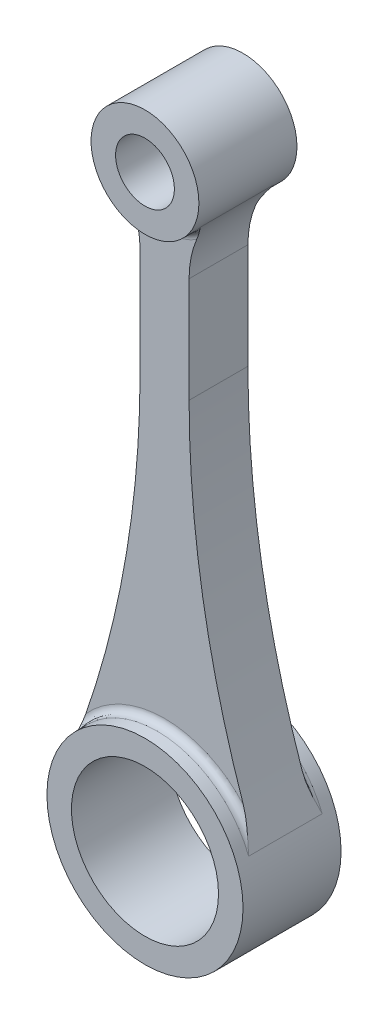
ISO-10303-21;
HEADER;
FILE_DESCRIPTION(('STEP AP214'),'2;1');
FILE_NAME('part.step','',(''),(''),'','','');
FILE_SCHEMA(('AUTOMOTIVE_DESIGN { 1 0 10303 214 1 1 1 1 }'));
ENDSEC;
DATA;
#1=APPLICATION_CONTEXT('core data for automotive mechanical design processes');
#2=APPLICATION_PROTOCOL_DEFINITION('international standard','automotive_design',2000,#1);
#3=PRODUCT_CONTEXT('',#1,'mechanical');
#4=PRODUCT('Part','Part','',(#3));
#5=PRODUCT_RELATED_PRODUCT_CATEGORY('part','',(#4));
#6=PRODUCT_DEFINITION_FORMATION('','',#4);
#7=PRODUCT_DEFINITION_CONTEXT('part definition',#1,'design');
#8=PRODUCT_DEFINITION('design','',#6,#7);
#9=PRODUCT_DEFINITION_SHAPE('','',#8);
#10=(LENGTH_UNIT() NAMED_UNIT(*) SI_UNIT(.MILLI.,.METRE.));
#11=(NAMED_UNIT(*) PLANE_ANGLE_UNIT() SI_UNIT($,.RADIAN.));
#12=(NAMED_UNIT(*) SI_UNIT($,.STERADIAN.) SOLID_ANGLE_UNIT());
#13=UNCERTAINTY_MEASURE_WITH_UNIT(LENGTH_MEASURE(1.E-05),#10,'distance_accuracy_value','');
#14=(GEOMETRIC_REPRESENTATION_CONTEXT(3) GLOBAL_UNCERTAINTY_ASSIGNED_CONTEXT((#13)) GLOBAL_UNIT_ASSIGNED_CONTEXT((#10,
#11,#12)) REPRESENTATION_CONTEXT('',''));
#15=CARTESIAN_POINT('',(0.,0.,0.));
#16=DIRECTION('',(0.,0.,1.));
#17=DIRECTION('',(1.,0.,0.));
#18=AXIS2_PLACEMENT_3D('',#15,#16,#17);
#19=CARTESIAN_POINT('',(0.,0.,10.));
#20=DIRECTION('',(0.,0.,1.));
#21=DIRECTION('',(1.,0.,0.));
#22=AXIS2_PLACEMENT_3D('',#19,#20,#21);
#23=PLANE('',#22);
#24=CARTESIAN_POINT('',(0.,0.,10.));
#25=DIRECTION('',(0.,0.,1.));
#26=DIRECTION('',(1.,0.,0.));
#27=AXIS2_PLACEMENT_3D('',#24,#25,#26);
#28=CIRCLE('',#27,20.);
#29=CARTESIAN_POINT('',(20.,0.,10.));
#30=VERTEX_POINT('',#29);
#31=EDGE_CURVE('E188',#30,#30,#28,.T.);
#32=ORIENTED_EDGE('',*,*,#31,.T.);
#33=EDGE_LOOP('',(#32));
#34=FACE_BOUND('',#33,.T.);
#35=CARTESIAN_POINT('',(0.,0.,10.));
#36=DIRECTION('',(0.,0.,1.));
#37=DIRECTION('',(1.,0.,0.));
#38=AXIS2_PLACEMENT_3D('',#35,#36,#37);
#39=CIRCLE('',#38,15.);
#40=CARTESIAN_POINT('',(15.,0.,10.));
#41=VERTEX_POINT('',#40);
#42=EDGE_CURVE('E182',#41,#41,#39,.T.);
#43=ORIENTED_EDGE('',*,*,#42,.F.);
#44=EDGE_LOOP('',(#43));
#45=FACE_BOUND('',#44,.T.);
#46=ADVANCED_FACE('F37',(#34,#45),#23,.T.);
#47=CARTESIAN_POINT('',(0.,0.,-10.));
#48=DIRECTION('',(0.,0.,1.));
#49=DIRECTION('',(1.,0.,0.));
#50=AXIS2_PLACEMENT_3D('',#47,#48,#49);
#51=PLANE('',#50);
#52=CARTESIAN_POINT('',(0.,0.,-10.));
#53=DIRECTION('',(0.,0.,1.));
#54=DIRECTION('',(1.,0.,0.));
#55=AXIS2_PLACEMENT_3D('',#52,#53,#54);
#56=CIRCLE('',#55,20.);
#57=CARTESIAN_POINT('',(20.,0.,-10.));
#58=VERTEX_POINT('',#57);
#59=EDGE_CURVE('E185',#58,#58,#56,.T.);
#60=ORIENTED_EDGE('',*,*,#59,.F.);
#61=EDGE_LOOP('',(#60));
#62=FACE_BOUND('',#61,.T.);
#63=CARTESIAN_POINT('',(0.,0.,-10.));
#64=DIRECTION('',(0.,0.,1.));
#65=DIRECTION('',(1.,0.,0.));
#66=AXIS2_PLACEMENT_3D('',#63,#64,#65);
#67=CIRCLE('',#66,15.);
#68=CARTESIAN_POINT('',(15.,0.,-10.));
#69=VERTEX_POINT('',#68);
#70=EDGE_CURVE('E155',#69,#69,#67,.T.);
#71=ORIENTED_EDGE('',*,*,#70,.T.);
#72=EDGE_LOOP('',(#71));
#73=FACE_BOUND('',#72,.T.);
#74=ADVANCED_FACE('F337',(#62,#73),#51,.F.);
#75=CARTESIAN_POINT('',(0.,0.,10.));
#76=DIRECTION('',(0.,0.,-1.));
#77=DIRECTION('',(-1.,0.,0.));
#78=AXIS2_PLACEMENT_3D('',#75,#76,#77);
#79=CYLINDRICAL_SURFACE('',#78,20.);
#80=CARTESIAN_POINT('',(0.,0.,-7.5));
#81=DIRECTION('',(0.,0.,1.));
#82=DIRECTION('',(1.,0.,0.));
#83=AXIS2_PLACEMENT_3D('',#80,#81,#82);
#84=CIRCLE('',#83,20.);
#85=CARTESIAN_POINT('',(-18.6481142651053,7.22826634509112,-7.5));
#86=VERTEX_POINT('',#85);
#87=CARTESIAN_POINT('',(18.6481142651053,7.22826634509116,-7.5));
#88=VERTEX_POINT('',#87);
#89=EDGE_CURVE('E206',#86,#88,#84,.F.);
#90=ORIENTED_EDGE('',*,*,#89,.T.);
#91=DIRECTION('',(0.,0.,-1.));
#92=VECTOR('',#91,1.);
#93=CARTESIAN_POINT('',(18.6481142651052,7.22826634509115,6.));
#94=LINE('',#93,#92);
#95=CARTESIAN_POINT('',(18.6481142651053,7.22826634509116,7.5));
#96=VERTEX_POINT('',#95);
#97=EDGE_CURVE('E179',#96,#88,#94,.T.);
#98=ORIENTED_EDGE('',*,*,#97,.F.);
#99=CARTESIAN_POINT('',(0.,0.,7.5));
#100=DIRECTION('',(0.,0.,1.));
#101=DIRECTION('',(1.,0.,0.));
#102=AXIS2_PLACEMENT_3D('',#99,#100,#101);
#103=CIRCLE('',#102,20.);
#104=CARTESIAN_POINT('',(-18.6481142651053,7.22826634509112,7.5));
#105=VERTEX_POINT('',#104);
#106=EDGE_CURVE('E203',#96,#105,#103,.T.);
#107=ORIENTED_EDGE('',*,*,#106,.T.);
#108=DIRECTION('',(0.,0.,-1.));
#109=VECTOR('',#108,1.);
#110=CARTESIAN_POINT('',(-18.6481142651053,7.22826634509112,6.));
#111=LINE('',#110,#109);
#112=EDGE_CURVE('E156',#105,#86,#111,.T.);
#113=ORIENTED_EDGE('',*,*,#112,.T.);
#114=EDGE_LOOP('',(#90,#98,#107,#113));
#115=FACE_BOUND('',#114,.T.);
#116=ORIENTED_EDGE('',*,*,#31,.F.);
#117=EDGE_LOOP('',(#116));
#118=FACE_BOUND('',#117,.T.);
#119=ORIENTED_EDGE('',*,*,#59,.T.);
#120=EDGE_LOOP('',(#119));
#121=FACE_BOUND('',#120,.T.);
#122=ADVANCED_FACE('F285',(#115,#118,#121),#79,.T.);
#123=CARTESIAN_POINT('',(0.,0.,10.));
#124=DIRECTION('',(0.,0.,-1.));
#125=DIRECTION('',(-1.,0.,0.));
#126=AXIS2_PLACEMENT_3D('',#123,#124,#125);
#127=CYLINDRICAL_SURFACE('',#126,15.);
#128=ORIENTED_EDGE('',*,*,#42,.T.);
#129=EDGE_LOOP('',(#128));
#130=FACE_BOUND('',#129,.T.);
#131=ORIENTED_EDGE('',*,*,#70,.F.);
#132=EDGE_LOOP('',(#131));
#133=FACE_BOUND('',#132,.T.);
#134=ADVANCED_FACE('F336',(#130,#133),#127,.F.);
#135=CARTESIAN_POINT('',(-5.,80.2020410288673,6.));
#136=DIRECTION('',(1.,0.,0.));
#137=DIRECTION('',(0.,1.,0.));
#138=AXIS2_PLACEMENT_3D('',#135,#136,#137);
#139=PLANE('',#138);
#140=DIRECTION('',(0.,-1.,0.));
#141=VECTOR('',#140,1.);
#142=CARTESIAN_POINT('',(-5.,80.2020410288673,6.));
#143=LINE('',#142,#141);
#144=CARTESIAN_POINT('',(-5.,101.669697220177,6.));
#145=VERTEX_POINT('',#144);
#146=CARTESIAN_POINT('',(-5.,80.2020410288673,6.));
#147=VERTEX_POINT('',#146);
#148=EDGE_CURVE('E132',#145,#147,#143,.T.);
#149=ORIENTED_EDGE('',*,*,#148,.F.);
#150=DIRECTION('',(0.,0.,1.));
#151=VECTOR('',#150,1.);
#152=CARTESIAN_POINT('',(-5.,101.669697220177,-7.5));
#153=LINE('',#152,#151);
#154=CARTESIAN_POINT('',(-5.,101.669697220177,-6.));
#155=VERTEX_POINT('',#154);
#156=EDGE_CURVE('E315',#145,#155,#153,.F.);
#157=ORIENTED_EDGE('',*,*,#156,.T.);
#158=DIRECTION('',(0.,-1.,0.));
#159=VECTOR('',#158,1.);
#160=CARTESIAN_POINT('',(-5.,80.2020410288673,-6.));
#161=LINE('',#160,#159);
#162=CARTESIAN_POINT('',(-5.,80.2020410288673,-6.));
#163=VERTEX_POINT('',#162);
#164=EDGE_CURVE('E151',#155,#163,#161,.T.);
#165=ORIENTED_EDGE('',*,*,#164,.T.);
#166=DIRECTION('',(0.,0.,-1.));
#167=VECTOR('',#166,1.);
#168=CARTESIAN_POINT('',(-5.,80.2020410288673,6.));
#169=LINE('',#168,#167);
#170=EDGE_CURVE('E148',#147,#163,#169,.T.);
#171=ORIENTED_EDGE('',*,*,#170,.F.);
#172=EDGE_LOOP('',(#149,#157,#165,#171));
#173=FACE_BOUND('',#172,.T.);
#174=ADVANCED_FACE('F149',(#173),#139,.F.);
#175=CARTESIAN_POINT('',(-206.912246173204,80.2020410288673,6.));
#176=DIRECTION('',(0.,0.,-1.));
#177=DIRECTION('',(-1.,0.,0.));
#178=AXIS2_PLACEMENT_3D('',#175,#176,#177);
#179=CYLINDRICAL_SURFACE('',#178,201.912246173204);
#180=CARTESIAN_POINT('',(-206.912246173204,80.2020410288673,-6.));
#181=DIRECTION('',(0.,0.,-1.));
#182=DIRECTION('',(-1.,0.,0.));
#183=AXIS2_PLACEMENT_3D('',#180,#181,#182);
#184=CIRCLE('',#183,201.912246173204);
#185=CARTESIAN_POINT('',(-16.0593915870727,14.2949621144325,-6.));
#186=VERTEX_POINT('',#185);
#187=EDGE_CURVE('E170',#163,#186,#184,.T.);
#188=ORIENTED_EDGE('',*,*,#187,.T.);
#189=CARTESIAN_POINT('',(-16.0593915870727,14.2949621144325,-6.));
#190=CARTESIAN_POINT('',(-16.1006536952667,14.1754753958452,-6.00001602232113));
#191=CARTESIAN_POINT('',(-16.1420221672801,14.0560452300221,-6.00236364174547));
#192=CARTESIAN_POINT('',(-16.2249250693915,13.8174294281499,-6.01122841546134));
#193=CARTESIAN_POINT('',(-16.2664594535402,13.6982437365931,-6.01774448543631));
#194=CARTESIAN_POINT('',(-16.3496188353424,13.4603293139308,-6.03444296750586));
#195=CARTESIAN_POINT('',(-16.3912436637881,13.3416002055074,-6.04462095780562));
#196=CARTESIAN_POINT('',(-16.4746143558816,13.104505043301,-6.06824871526225));
#197=CARTESIAN_POINT('',(-16.516360228226,12.986139016928,-6.0816987235622));
#198=CARTESIAN_POINT('',(-16.6413582816495,12.6327683299751,-6.12627700219606));
#199=CARTESIAN_POINT('',(-16.7247668152754,12.3983585047795,-6.16172009800719));
#200=CARTESIAN_POINT('',(-16.891958753983,11.9312046260724,-6.24186223068305));
#201=CARTESIAN_POINT('',(-16.975742285482,11.6984612159025,-6.28656466186986));
#202=CARTESIAN_POINT('',(-17.1890070534447,11.1094074843419,-6.40949821500776));
#203=CARTESIAN_POINT('',(-17.3187304550133,10.7542484759836,-6.49279850831516));
#204=CARTESIAN_POINT('',(-17.5791415039691,10.0474088872057,-6.67147800946625));
#205=CARTESIAN_POINT('',(-17.7098291679299,9.69572836681819,-6.76685742538211));
#206=CARTESIAN_POINT('',(-18.1041013686497,8.64365924995231,-7.06469767403907));
#207=CARTESIAN_POINT('',(-18.3695278193063,7.94725690798134,-7.27862120682472));
#208=CARTESIAN_POINT('',(-18.6418666749909,7.24438596708921,-7.49503656019401));
#209=CARTESIAN_POINT('',(-18.6449902140357,7.23632605190579,-7.49751829132836));
#210=CARTESIAN_POINT('',(-18.6481142651053,7.22826634509112,-7.5));
#211=B_SPLINE_CURVE_WITH_KNOTS('',3,(#189,#190,#191,#192,#193,#194,#195,#196,#197,#198,#199,
#200,#201,#202,#203,#204,#205,#206,#207,#208,#209,#210),.UNSPECIFIED.,.F.,.F.,(4,2,2,2,2,2,2,2,
2,2,4),(0.,0.379183324240389,0.758268053651415,1.13689656343055,1.51555298605122,
2.26926103822404,3.0232458780853,4.18443837654385,5.34565088015677,7.67138597053266,
7.69836558191359),.UNSPECIFIED.);
#212=EDGE_CURVE('E217',#186,#86,#211,.T.);
#213=ORIENTED_EDGE('',*,*,#212,.T.);
#214=ORIENTED_EDGE('',*,*,#112,.F.);
#215=CARTESIAN_POINT('',(-16.0593915870727,14.2949621144325,6.));
#216=CARTESIAN_POINT('',(-16.1006536952667,14.1754753958452,6.00001602232113));
#217=CARTESIAN_POINT('',(-16.1420221672801,14.0560452300221,6.00236364174547));
#218=CARTESIAN_POINT('',(-16.2249250693915,13.8174294281499,6.01122841546134));
#219=CARTESIAN_POINT('',(-16.2664594535402,13.6982437365931,6.0177444854363));
#220=CARTESIAN_POINT('',(-16.3496188353424,13.4603293139308,6.03444296750586));
#221=CARTESIAN_POINT('',(-16.3912436637881,13.3416002055074,6.04462095780561));
#222=CARTESIAN_POINT('',(-16.4746143558816,13.104505043301,6.06824871526224));
#223=CARTESIAN_POINT('',(-16.516360228226,12.986139016928,6.0816987235622));
#224=CARTESIAN_POINT('',(-16.6413582816495,12.6327683299751,6.12627700219606));
#225=CARTESIAN_POINT('',(-16.7247668152754,12.3983585047795,6.16172009800719));
#226=CARTESIAN_POINT('',(-16.891958753983,11.9312046260724,6.24186223068305));
#227=CARTESIAN_POINT('',(-16.975742285482,11.6984612159025,6.28656466186986));
#228=CARTESIAN_POINT('',(-17.1890070534447,11.1094074843419,6.40949821500776));
#229=CARTESIAN_POINT('',(-17.3187304550133,10.7542484759836,6.49279850831517));
#230=CARTESIAN_POINT('',(-17.5791415039691,10.0474088872057,6.67147800946626));
#231=CARTESIAN_POINT('',(-17.7098291679299,9.69572836681819,6.76685742538212));
#232=CARTESIAN_POINT('',(-18.1041013686497,8.64365924995231,7.06469767403908));
#233=CARTESIAN_POINT('',(-18.3695278193063,7.94725690798134,7.27862120682471));
#234=CARTESIAN_POINT('',(-18.6418666749909,7.24438596708921,7.49503656019401));
#235=CARTESIAN_POINT('',(-18.6449902140357,7.23632605190579,7.49751829132836));
#236=CARTESIAN_POINT('',(-18.6481142651053,7.22826634509112,7.5));
#237=B_SPLINE_CURVE_WITH_KNOTS('',3,(#215,#216,#217,#218,#219,#220,#221,#222,#223,#224,#225,
#226,#227,#228,#229,#230,#231,#232,#233,#234,#235,#236),.UNSPECIFIED.,.F.,.F.,(4,2,2,2,2,2,2,2,
2,2,4),(0.,0.37918332424039,0.758268053651414,1.13689656343055,1.51555298605122,
2.26926103822403,3.0232458780853,4.18443837654385,5.34565088015677,7.67138597053266,
7.69836558191359),.UNSPECIFIED.);
#238=CARTESIAN_POINT('',(-16.0593915870727,14.2949621144325,6.));
#239=VERTEX_POINT('',#238);
#240=EDGE_CURVE('E160',#105,#239,#237,.F.);
#241=ORIENTED_EDGE('',*,*,#240,.T.);
#242=CARTESIAN_POINT('',(-206.912246173204,80.2020410288673,6.));
#243=DIRECTION('',(0.,0.,-1.));
#244=DIRECTION('',(-1.,0.,0.));
#245=AXIS2_PLACEMENT_3D('',#242,#243,#244);
#246=CIRCLE('',#245,201.912246173204);
#247=EDGE_CURVE('E138',#147,#239,#246,.T.);
#248=ORIENTED_EDGE('',*,*,#247,.F.);
#249=ORIENTED_EDGE('',*,*,#170,.T.);
#250=EDGE_LOOP('',(#188,#213,#214,#241,#248,#249));
#251=FACE_BOUND('',#250,.T.);
#252=ADVANCED_FACE('F158',(#251),#179,.F.);
#253=CARTESIAN_POINT('',(206.912246173204,80.2020410288673,6.));
#254=DIRECTION('',(0.,0.,-1.));
#255=DIRECTION('',(-1.,0.,0.));
#256=AXIS2_PLACEMENT_3D('',#253,#254,#255);
#257=CYLINDRICAL_SURFACE('',#256,201.912246173204);
#258=ORIENTED_EDGE('',*,*,#97,.T.);
#259=CARTESIAN_POINT('',(16.0593915870726,14.2949621144326,-6.));
#260=CARTESIAN_POINT('',(16.1006536952674,14.1754753958429,-6.00001602232114));
#261=CARTESIAN_POINT('',(16.1420221672817,14.0560452300176,-6.00236364174556));
#262=CARTESIAN_POINT('',(16.2249250693946,13.8174294281407,-6.01122841546176));
#263=CARTESIAN_POINT('',(16.2664594535442,13.6982437365816,-6.01774448543697));
#264=CARTESIAN_POINT('',(16.3496188353478,13.4603293139152,-6.03444296750711));
#265=CARTESIAN_POINT('',(16.3912436637941,13.34160020549,-6.04462095780719));
#266=CARTESIAN_POINT('',(16.4746143558889,13.10450504328,-6.06824871526452));
#267=CARTESIAN_POINT('',(16.516360228234,12.9861390169052,-6.08169872356485));
#268=CARTESIAN_POINT('',(16.6413582816566,12.632768329955,-6.12627700219907));
#269=CARTESIAN_POINT('',(16.7247668152809,12.3983585047639,-6.16172009801002));
#270=CARTESIAN_POINT('',(16.8919587539857,11.9312046260648,-6.24186223068424));
#271=CARTESIAN_POINT('',(16.9757422854834,11.6984612158985,-6.28656466186961));
#272=CARTESIAN_POINT('',(17.1890070534442,11.109407484343,-6.40949821500931));
#273=CARTESIAN_POINT('',(17.318730455012,10.7542484759869,-6.49279850832254));
#274=CARTESIAN_POINT('',(17.5791415039686,10.0474088872073,-6.67147800945777));
#275=CARTESIAN_POINT('',(17.709829167931,9.69572836681585,-6.76685742535191));
#276=CARTESIAN_POINT('',(18.1041013686416,8.64365924997218,-7.06469767409545));
#277=CARTESIAN_POINT('',(18.3695278192712,7.9472569080674,-7.27862120714021));
#278=CARTESIAN_POINT('',(18.6418666749902,7.2443859670909,-7.4950365602014));
#279=CARTESIAN_POINT('',(18.6449902140354,7.23632605190665,-7.49751829133209));
#280=CARTESIAN_POINT('',(18.6481142651053,7.22826634509113,-7.5));
#281=B_SPLINE_CURVE_WITH_KNOTS('',3,(#259,#260,#261,#262,#263,#264,#265,#266,#267,#268,#269,
#270,#271,#272,#273,#274,#275,#276,#277,#278,#279,#280),.UNSPECIFIED.,.F.,.F.,(4,2,2,2,2,2,2,2,
2,2,4),(0.,0.379183324247747,0.758268053666146,1.13689656345106,1.5155529860775,2.2692610382363,
3.02324587808531,4.18443837654188,5.34565088014911,7.6713859705331,7.69836558191358),.UNSPECIFIED.);
#282=CARTESIAN_POINT('',(16.0593915870726,14.2949621144326,-6.));
#283=VERTEX_POINT('',#282);
#284=EDGE_CURVE('E209',#88,#283,#281,.F.);
#285=ORIENTED_EDGE('',*,*,#284,.T.);
#286=CARTESIAN_POINT('',(206.912246173204,80.2020410288673,-6.));
#287=DIRECTION('',(0.,0.,-1.));
#288=DIRECTION('',(1.,0.,0.));
#289=AXIS2_PLACEMENT_3D('',#286,#287,#288);
#290=CIRCLE('',#289,201.912246173204);
#291=CARTESIAN_POINT('',(5.,80.2020410288673,-6.));
#292=VERTEX_POINT('',#291);
#293=EDGE_CURVE('E173',#283,#292,#290,.T.);
#294=ORIENTED_EDGE('',*,*,#293,.T.);
#295=DIRECTION('',(0.,0.,-1.));
#296=VECTOR('',#295,1.);
#297=CARTESIAN_POINT('',(5.,80.2020410288673,6.));
#298=LINE('',#297,#296);
#299=CARTESIAN_POINT('',(5.,80.2020410288673,6.));
#300=VERTEX_POINT('',#299);
#301=EDGE_CURVE('E168',#300,#292,#298,.T.);
#302=ORIENTED_EDGE('',*,*,#301,.F.);
#303=CARTESIAN_POINT('',(206.912246173204,80.2020410288673,6.));
#304=DIRECTION('',(0.,0.,-1.));
#305=DIRECTION('',(1.,0.,0.));
#306=AXIS2_PLACEMENT_3D('',#303,#304,#305);
#307=CIRCLE('',#306,201.912246173204);
#308=CARTESIAN_POINT('',(16.0593915870726,14.2949621144326,6.));
#309=VERTEX_POINT('',#308);
#310=EDGE_CURVE('E161',#309,#300,#307,.T.);
#311=ORIENTED_EDGE('',*,*,#310,.F.);
#312=CARTESIAN_POINT('',(16.0593915870726,14.2949621144326,6.));
#313=CARTESIAN_POINT('',(16.1006536952674,14.1754753958429,6.00001602232114));
#314=CARTESIAN_POINT('',(16.1420221672817,14.0560452300176,6.00236364174556));
#315=CARTESIAN_POINT('',(16.2249250693946,13.8174294281407,6.01122841546176));
#316=CARTESIAN_POINT('',(16.2664594535442,13.6982437365816,6.01774448543697));
#317=CARTESIAN_POINT('',(16.3496188353478,13.4603293139152,6.03444296750711));
#318=CARTESIAN_POINT('',(16.3912436637942,13.34160020549,6.04462095780719));
#319=CARTESIAN_POINT('',(16.474614355889,13.10450504328,6.06824871526452));
#320=CARTESIAN_POINT('',(16.516360228234,12.9861390169052,6.08169872356485));
#321=CARTESIAN_POINT('',(16.6413582816566,12.632768329955,6.12627700219907));
#322=CARTESIAN_POINT('',(16.7247668152809,12.3983585047639,6.16172009801002));
#323=CARTESIAN_POINT('',(16.8919587539857,11.9312046260648,6.24186223068424));
#324=CARTESIAN_POINT('',(16.9757422854834,11.6984612158985,6.28656466186961));
#325=CARTESIAN_POINT('',(17.1890070534442,11.109407484343,6.40949821500931));
#326=CARTESIAN_POINT('',(17.318730455012,10.7542484759869,6.49279850832253));
#327=CARTESIAN_POINT('',(17.5791415039686,10.0474088872073,6.67147800945777));
#328=CARTESIAN_POINT('',(17.709829167931,9.69572836681585,6.76685742535191));
#329=CARTESIAN_POINT('',(18.1041013686416,8.64365924997218,7.06469767409545));
#330=CARTESIAN_POINT('',(18.3695278192712,7.9472569080674,7.27862120714021));
#331=CARTESIAN_POINT('',(18.6418666749902,7.2443859670909,7.4950365602014));
#332=CARTESIAN_POINT('',(18.6449902140354,7.23632605190665,7.49751829133209));
#333=CARTESIAN_POINT('',(18.6481142651053,7.22826634509113,7.5));
#334=B_SPLINE_CURVE_WITH_KNOTS('',3,(#312,#313,#314,#315,#316,#317,#318,#319,#320,#321,#322,
#323,#324,#325,#326,#327,#328,#329,#330,#331,#332,#333),.UNSPECIFIED.,.F.,.F.,(4,2,2,2,2,2,2,2,
2,2,4),(0.,0.379183324247746,0.758268053666146,1.13689656345107,1.5155529860775,2.2692610382363,
3.02324587808531,4.18443837654188,5.34565088014911,7.6713859705331,7.69836558191358),.UNSPECIFIED.);
#335=EDGE_CURVE('E237',#309,#96,#334,.T.);
#336=ORIENTED_EDGE('',*,*,#335,.T.);
#337=EDGE_LOOP('',(#258,#285,#294,#302,#311,#336));
#338=FACE_BOUND('',#337,.T.);
#339=ADVANCED_FACE('F227',(#338),#257,.F.);
#340=CARTESIAN_POINT('',(5.,110.202041028867,6.));
#341=DIRECTION('',(-1.,0.,0.));
#342=DIRECTION('',(0.,-1.,0.));
#343=AXIS2_PLACEMENT_3D('',#340,#341,#342);
#344=PLANE('',#343);
#345=DIRECTION('',(0.,1.,0.));
#346=VECTOR('',#345,1.);
#347=CARTESIAN_POINT('',(5.,110.202041028867,-6.));
#348=LINE('',#347,#346);
#349=CARTESIAN_POINT('',(5.,101.669697220177,-6.));
#350=VERTEX_POINT('',#349);
#351=EDGE_CURVE('E145',#292,#350,#348,.T.);
#352=ORIENTED_EDGE('',*,*,#351,.T.);
#353=DIRECTION('',(0.,0.,1.));
#354=VECTOR('',#353,1.);
#355=CARTESIAN_POINT('',(5.,101.669697220177,7.5));
#356=LINE('',#355,#354);
#357=CARTESIAN_POINT('',(5.,101.669697220177,6.));
#358=VERTEX_POINT('',#357);
#359=EDGE_CURVE('E313',#350,#358,#356,.T.);
#360=ORIENTED_EDGE('',*,*,#359,.T.);
#361=DIRECTION('',(0.,1.,0.));
#362=VECTOR('',#361,1.);
#363=CARTESIAN_POINT('',(5.,110.202041028867,6.));
#364=LINE('',#363,#362);
#365=EDGE_CURVE('E163',#300,#358,#364,.T.);
#366=ORIENTED_EDGE('',*,*,#365,.F.);
#367=ORIENTED_EDGE('',*,*,#301,.T.);
#368=EDGE_LOOP('',(#352,#360,#366,#367));
#369=FACE_BOUND('',#368,.T.);
#370=ADVANCED_FACE('F231',(#369),#344,.F.);
#371=CARTESIAN_POINT('',(0.,120.,6.));
#372=DIRECTION('',(0.,0.,1.));
#373=DIRECTION('',(1.,0.,0.));
#374=AXIS2_PLACEMENT_3D('',#371,#372,#373);
#375=PLANE('',#374);
#376=ORIENTED_EDGE('',*,*,#365,.T.);
#377=CARTESIAN_POINT('',(25.,101.669697220177,6.));
#378=DIRECTION('',(0.,0.,1.));
#379=DIRECTION('',(1.,0.,0.));
#380=AXIS2_PLACEMENT_3D('',#377,#378,#379);
#381=CIRCLE('',#380,20.);
#382=CARTESIAN_POINT('',(6.52976453851342,109.341098786856,6.));
#383=VERTEX_POINT('',#382);
#384=EDGE_CURVE('E51',#358,#383,#381,.F.);
#385=ORIENTED_EDGE('',*,*,#384,.T.);
#386=CARTESIAN_POINT('',(0.,120.,6.));
#387=DIRECTION('',(0.,0.,1.));
#388=DIRECTION('',(1.,0.,0.));
#389=AXIS2_PLACEMENT_3D('',#386,#387,#388);
#390=CIRCLE('',#389,12.5);
#391=CARTESIAN_POINT('',(-6.52976453851341,109.341098786856,6.));
#392=VERTEX_POINT('',#391);
#393=EDGE_CURVE('E57',#383,#392,#390,.F.);
#394=ORIENTED_EDGE('',*,*,#393,.T.);
#395=CARTESIAN_POINT('',(-25.,101.669697220177,6.));
#396=DIRECTION('',(0.,0.,1.));
#397=DIRECTION('',(1.,0.,0.));
#398=AXIS2_PLACEMENT_3D('',#395,#396,#397);
#399=CIRCLE('',#398,20.);
#400=EDGE_CURVE('E141',#392,#145,#399,.F.);
#401=ORIENTED_EDGE('',*,*,#400,.T.);
#402=ORIENTED_EDGE('',*,*,#148,.T.);
#403=ORIENTED_EDGE('',*,*,#247,.T.);
#404=CARTESIAN_POINT('',(0.,0.,6.));
#405=DIRECTION('',(0.,0.,1.));
#406=DIRECTION('',(1.,0.,0.));
#407=AXIS2_PLACEMENT_3D('',#404,#405,#406);
#408=CIRCLE('',#407,21.5);
#409=EDGE_CURVE('E200',#239,#309,#408,.F.);
#410=ORIENTED_EDGE('',*,*,#409,.T.);
#411=ORIENTED_EDGE('',*,*,#310,.T.);
#412=EDGE_LOOP('',(#376,#385,#394,#401,#402,#403,#410,#411));
#413=FACE_BOUND('',#412,.T.);
#414=ADVANCED_FACE('F135',(#413),#375,.T.);
#415=CARTESIAN_POINT('',(0.,120.,-6.));
#416=DIRECTION('',(0.,0.,1.));
#417=DIRECTION('',(1.,0.,0.));
#418=AXIS2_PLACEMENT_3D('',#415,#416,#417);
#419=PLANE('',#418);
#420=ORIENTED_EDGE('',*,*,#164,.F.);
#421=CARTESIAN_POINT('',(-25.,101.669697220177,-6.));
#422=DIRECTION('',(0.,0.,1.));
#423=DIRECTION('',(1.,0.,0.));
#424=AXIS2_PLACEMENT_3D('',#421,#422,#423);
#425=CIRCLE('',#424,20.);
#426=CARTESIAN_POINT('',(-6.52976453851341,109.341098786856,-6.));
#427=VERTEX_POINT('',#426);
#428=EDGE_CURVE('E316',#155,#427,#425,.T.);
#429=ORIENTED_EDGE('',*,*,#428,.T.);
#430=CARTESIAN_POINT('',(0.,120.,-6.));
#431=DIRECTION('',(0.,0.,1.));
#432=DIRECTION('',(1.,0.,0.));
#433=AXIS2_PLACEMENT_3D('',#430,#431,#432);
#434=CIRCLE('',#433,12.5);
#435=CARTESIAN_POINT('',(6.52976453851342,109.341098786856,-6.));
#436=VERTEX_POINT('',#435);
#437=EDGE_CURVE('E65',#427,#436,#434,.T.);
#438=ORIENTED_EDGE('',*,*,#437,.T.);
#439=CARTESIAN_POINT('',(25.,101.669697220177,-6.));
#440=DIRECTION('',(0.,0.,1.));
#441=DIRECTION('',(1.,0.,0.));
#442=AXIS2_PLACEMENT_3D('',#439,#440,#441);
#443=CIRCLE('',#442,20.);
#444=EDGE_CURVE('E294',#436,#350,#443,.T.);
#445=ORIENTED_EDGE('',*,*,#444,.T.);
#446=ORIENTED_EDGE('',*,*,#351,.F.);
#447=ORIENTED_EDGE('',*,*,#293,.F.);
#448=CARTESIAN_POINT('',(0.,0.,-6.));
#449=DIRECTION('',(0.,0.,1.));
#450=DIRECTION('',(1.,0.,0.));
#451=AXIS2_PLACEMENT_3D('',#448,#449,#450);
#452=CIRCLE('',#451,21.5);
#453=EDGE_CURVE('E197',#283,#186,#452,.T.);
#454=ORIENTED_EDGE('',*,*,#453,.T.);
#455=ORIENTED_EDGE('',*,*,#187,.F.);
#456=EDGE_LOOP('',(#420,#429,#438,#445,#446,#447,#454,#455));
#457=FACE_BOUND('',#456,.T.);
#458=ADVANCED_FACE('F321',(#457),#419,.F.);
#459=CARTESIAN_POINT('',(0.,120.,10.));
#460=DIRECTION('',(0.,0.,1.));
#461=DIRECTION('',(1.,0.,0.));
#462=AXIS2_PLACEMENT_3D('',#459,#460,#461);
#463=PLANE('',#462);
#464=CARTESIAN_POINT('',(0.,120.,10.));
#465=DIRECTION('',(0.,0.,1.));
#466=DIRECTION('',(1.,0.,0.));
#467=AXIS2_PLACEMENT_3D('',#464,#465,#466);
#468=CIRCLE('',#467,11.);
#469=CARTESIAN_POINT('',(11.,120.,10.));
#470=VERTEX_POINT('',#469);
#471=EDGE_CURVE('E171',#470,#470,#468,.T.);
#472=ORIENTED_EDGE('',*,*,#471,.T.);
#473=EDGE_LOOP('',(#472));
#474=FACE_BOUND('',#473,.T.);
#475=CARTESIAN_POINT('',(0.,120.,10.));
#476=DIRECTION('',(0.,0.,1.));
#477=DIRECTION('',(1.,0.,0.));
#478=AXIS2_PLACEMENT_3D('',#475,#476,#477);
#479=CIRCLE('',#478,6.00000000000001);
#480=CARTESIAN_POINT('',(6.00000000000001,120.,10.));
#481=VERTEX_POINT('',#480);
#482=EDGE_CURVE('E492',#481,#481,#479,.T.);
#483=ORIENTED_EDGE('',*,*,#482,.F.);
#484=EDGE_LOOP('',(#483));
#485=FACE_BOUND('',#484,.T.);
#486=ADVANCED_FACE('F432',(#474,#485),#463,.T.);
#487=CARTESIAN_POINT('',(0.,120.,-10.));
#488=DIRECTION('',(0.,0.,1.));
#489=DIRECTION('',(1.,0.,0.));
#490=AXIS2_PLACEMENT_3D('',#487,#488,#489);
#491=PLANE('',#490);
#492=CARTESIAN_POINT('',(0.,120.,-10.));
#493=DIRECTION('',(0.,0.,1.));
#494=DIRECTION('',(1.,0.,0.));
#495=AXIS2_PLACEMENT_3D('',#492,#493,#494);
#496=CIRCLE('',#495,11.);
#497=CARTESIAN_POINT('',(11.,120.,-10.));
#498=VERTEX_POINT('',#497);
#499=EDGE_CURVE('E488',#498,#498,#496,.T.);
#500=ORIENTED_EDGE('',*,*,#499,.F.);
#501=EDGE_LOOP('',(#500));
#502=FACE_BOUND('',#501,.T.);
#503=CARTESIAN_POINT('',(0.,120.,-10.));
#504=DIRECTION('',(0.,0.,1.));
#505=DIRECTION('',(1.,0.,0.));
#506=AXIS2_PLACEMENT_3D('',#503,#504,#505);
#507=CIRCLE('',#506,6.00000000000001);
#508=CARTESIAN_POINT('',(6.00000000000001,120.,-10.));
#509=VERTEX_POINT('',#508);
#510=EDGE_CURVE('E491',#509,#509,#507,.T.);
#511=ORIENTED_EDGE('',*,*,#510,.T.);
#512=EDGE_LOOP('',(#511));
#513=FACE_BOUND('',#512,.T.);
#514=ADVANCED_FACE('F440',(#502,#513),#491,.F.);
#515=CARTESIAN_POINT('',(0.,120.,10.));
#516=DIRECTION('',(0.,0.,-1.));
#517=DIRECTION('',(-1.,0.,0.));
#518=AXIS2_PLACEMENT_3D('',#515,#516,#517);
#519=CYLINDRICAL_SURFACE('',#518,11.);
#520=CARTESIAN_POINT('',(0.,120.,-7.5));
#521=DIRECTION('',(0.,0.,1.));
#522=DIRECTION('',(1.,0.,0.));
#523=AXIS2_PLACEMENT_3D('',#520,#521,#522);
#524=CIRCLE('',#523,11.);
#525=CARTESIAN_POINT('',(8.87096774193549,113.495699013611,-7.5));
#526=VERTEX_POINT('',#525);
#527=CARTESIAN_POINT('',(-8.87096774193549,113.495699013611,-7.5));
#528=VERTEX_POINT('',#527);
#529=EDGE_CURVE('E195',#526,#528,#524,.F.);
#530=ORIENTED_EDGE('',*,*,#529,.T.);
#531=DIRECTION('',(0.,0.,-1.));
#532=VECTOR('',#531,1.);
#533=CARTESIAN_POINT('',(-8.87096774193549,113.495699013611,10.));
#534=LINE('',#533,#532);
#535=CARTESIAN_POINT('',(-8.87096774193549,113.495699013611,7.5));
#536=VERTEX_POINT('',#535);
#537=EDGE_CURVE('E308',#528,#536,#534,.F.);
#538=ORIENTED_EDGE('',*,*,#537,.T.);
#539=CARTESIAN_POINT('',(0.,120.,7.5));
#540=DIRECTION('',(0.,0.,1.));
#541=DIRECTION('',(1.,0.,0.));
#542=AXIS2_PLACEMENT_3D('',#539,#540,#541);
#543=CIRCLE('',#542,11.);
#544=CARTESIAN_POINT('',(8.87096774193549,113.495699013611,7.5));
#545=VERTEX_POINT('',#544);
#546=EDGE_CURVE('E191',#536,#545,#543,.T.);
#547=ORIENTED_EDGE('',*,*,#546,.T.);
#548=DIRECTION('',(0.,0.,-1.));
#549=VECTOR('',#548,1.);
#550=CARTESIAN_POINT('',(8.87096774193549,113.495699013611,10.));
#551=LINE('',#550,#549);
#552=EDGE_CURVE('E303',#545,#526,#551,.T.);
#553=ORIENTED_EDGE('',*,*,#552,.T.);
#554=EDGE_LOOP('',(#530,#538,#547,#553));
#555=FACE_BOUND('',#554,.T.);
#556=ORIENTED_EDGE('',*,*,#471,.F.);
#557=EDGE_LOOP('',(#556));
#558=FACE_BOUND('',#557,.T.);
#559=ORIENTED_EDGE('',*,*,#499,.T.);
#560=EDGE_LOOP('',(#559));
#561=FACE_BOUND('',#560,.T.);
#562=ADVANCED_FACE('F309',(#555,#558,#561),#519,.T.);
#563=CARTESIAN_POINT('',(0.,120.,10.));
#564=DIRECTION('',(0.,0.,-1.));
#565=DIRECTION('',(-1.,0.,0.));
#566=AXIS2_PLACEMENT_3D('',#563,#564,#565);
#567=CYLINDRICAL_SURFACE('',#566,6.00000000000001);
#568=ORIENTED_EDGE('',*,*,#482,.T.);
#569=EDGE_LOOP('',(#568));
#570=FACE_BOUND('',#569,.T.);
#571=ORIENTED_EDGE('',*,*,#510,.F.);
#572=EDGE_LOOP('',(#571));
#573=FACE_BOUND('',#572,.T.);
#574=ADVANCED_FACE('F283',(#570,#573),#567,.F.);
#575=CARTESIAN_POINT('',(0.,120.,-7.5));
#576=DIRECTION('',(0.,0.,1.));
#577=DIRECTION('',(1.,0.,0.));
#578=AXIS2_PLACEMENT_3D('',#575,#576,#577);
#579=TOROIDAL_SURFACE('',#578,12.5,1.5);
#580=ORIENTED_EDGE('',*,*,#529,.F.);
#581=CARTESIAN_POINT('',(6.52976453851342,109.341098786856,-6.));
#582=CARTESIAN_POINT('',(6.56118335819633,109.416747920778,-6.00000925177808));
#583=CARTESIAN_POINT('',(6.59305602448827,109.492171876018,-6.00231164516609));
#584=CARTESIAN_POINT('',(6.65761775350261,109.642380754178,-6.01103347793253));
#585=CARTESIAN_POINT('',(6.69030631753674,109.71716603168,-6.0174504589037));
#586=CARTESIAN_POINT('',(6.78931397381604,109.9399612642,-6.042124411477));
#587=CARTESIAN_POINT('',(6.85676792440509,110.086874644215,-6.06581023051418));
#588=CARTESIAN_POINT('',(6.9935015893875,110.375515680491,-6.12436470006672));
#589=CARTESIAN_POINT('',(7.06275434412563,110.517281815675,-6.15911205278858));
#590=CARTESIAN_POINT('',(7.2035844429761,110.797247014588,-6.23760984310479));
#591=CARTESIAN_POINT('',(7.27516380163162,110.935442790441,-6.28136826800793));
#592=CARTESIAN_POINT('',(7.46301782611866,111.288135152223,-6.40371242923498));
#593=CARTESIAN_POINT('',(7.58090625694681,111.499893338873,-6.48768150142482));
#594=CARTESIAN_POINT('',(7.82184465737998,111.915117050018,-6.66761005920623));
#595=CARTESIAN_POINT('',(7.94489547396966,112.118581202843,-6.76357151752111));
#596=CARTESIAN_POINT('',(8.19678616505625,112.519035660713,-6.96327814535071));
#597=CARTESIAN_POINT('',(8.32564406752489,112.716001970416,-7.06704833575966));
#598=CARTESIAN_POINT('',(8.58921706524397,113.103908169927,-7.27819082606436));
#599=CARTESIAN_POINT('',(8.72393100109567,113.294849239829,-7.38556241198994));
#600=CARTESIAN_POINT('',(8.86493484363084,113.487467664242,-7.49530812204677));
#601=CARTESIAN_POINT('',(8.8679505095689,113.49158391814,-7.49765406358551));
#602=CARTESIAN_POINT('',(8.87096774193548,113.495699013611,-7.5));
#603=B_SPLINE_CURVE_WITH_KNOTS('',3,(#581,#582,#583,#584,#585,#586,#587,#588,#589,#590,#591,
#592,#593,#594,#595,#596,#597,#598,#599,#600,#601,#602),.UNSPECIFIED.,.F.,.F.,(4,2,2,2,2,2,2,2,
2,2,4),(0.,0.245656008911222,0.491165378464529,0.980682937114044,1.46500748572257,
1.94976319620688,2.71855630954805,3.48747605468142,4.25897409193368,5.03032007474093,
5.04716854660824),.UNSPECIFIED.);
#604=EDGE_CURVE('E288',#526,#436,#603,.F.);
#605=ORIENTED_EDGE('',*,*,#604,.T.);
#606=ORIENTED_EDGE('',*,*,#437,.F.);
#607=CARTESIAN_POINT('',(-6.52976453851341,109.341098786856,-6.));
#608=CARTESIAN_POINT('',(-6.56118335819643,109.416747920779,-6.00000925177808));
#609=CARTESIAN_POINT('',(-6.59305602448848,109.492171876019,-6.0023116451661));
#610=CARTESIAN_POINT('',(-6.65761775350303,109.642380754179,-6.01103347793261));
#611=CARTESIAN_POINT('',(-6.69030631753727,109.717166031681,-6.01745045890381));
#612=CARTESIAN_POINT('',(-6.78931397381686,109.939961264202,-6.04212441147726));
#613=CARTESIAN_POINT('',(-6.8567679244061,110.086874644217,-6.06581023051456));
#614=CARTESIAN_POINT('',(-6.99350158938851,110.375515680493,-6.12436470006721));
#615=CARTESIAN_POINT('',(-7.06275434412643,110.517281815676,-6.159112052789));
#616=CARTESIAN_POINT('',(-7.20358444297649,110.797247014589,-6.23760984310504));
#617=CARTESIAN_POINT('',(-7.2751638016318,110.935442790441,-6.28136826800809));
#618=CARTESIAN_POINT('',(-7.46301782611864,111.288135152223,-6.40371242923491));
#619=CARTESIAN_POINT('',(-7.5809062569468,111.499893338872,-6.48768150142456));
#620=CARTESIAN_POINT('',(-7.82184465737971,111.915117050018,-6.66761005920631));
#621=CARTESIAN_POINT('',(-7.94489547396912,112.118581202843,-6.76357151752172));
#622=CARTESIAN_POINT('',(-8.19678616505614,112.519035660713,-6.9632781453496));
#623=CARTESIAN_POINT('',(-8.32564406752546,112.716001970417,-7.06704833575631));
#624=CARTESIAN_POINT('',(-8.58921706524294,113.103908169925,-7.27819082606745));
#625=CARTESIAN_POINT('',(-8.72393100109233,113.294849239825,-7.38556241200171));
#626=CARTESIAN_POINT('',(-8.86493484363074,113.487467664242,-7.49530812204731));
#627=CARTESIAN_POINT('',(-8.86795050956885,113.49158391814,-7.49765406358579));
#628=CARTESIAN_POINT('',(-8.87096774193549,113.495699013611,-7.5));
#629=B_SPLINE_CURVE_WITH_KNOTS('',3,(#607,#608,#609,#610,#611,#612,#613,#614,#615,#616,#617,
#618,#619,#620,#621,#622,#623,#624,#625,#626,#627,#628),.UNSPECIFIED.,.F.,.F.,(4,2,2,2,2,2,2,2,
2,2,4),(0.,0.245656008912038,0.491165378466146,0.98068293711693,1.46500748572392,
1.94976319620688,2.71855630954784,3.48747605468059,4.25897409193327,5.03032007474103,
5.04716854660823),.UNSPECIFIED.);
#630=EDGE_CURVE('E260',#427,#528,#629,.T.);
#631=ORIENTED_EDGE('',*,*,#630,.T.);
#632=EDGE_LOOP('',(#580,#605,#606,#631));
#633=FACE_BOUND('',#632,.T.);
#634=ADVANCED_FACE('F278',(#633),#579,.F.);
#635=CARTESIAN_POINT('',(0.,120.,7.5));
#636=DIRECTION('',(0.,0.,1.));
#637=DIRECTION('',(1.,0.,0.));
#638=AXIS2_PLACEMENT_3D('',#635,#636,#637);
#639=TOROIDAL_SURFACE('',#638,12.5,1.5);
#640=ORIENTED_EDGE('',*,*,#393,.F.);
#641=CARTESIAN_POINT('',(6.52976453851342,109.341098786856,6.));
#642=CARTESIAN_POINT('',(6.56118335819635,109.416747920778,6.00000925177807));
#643=CARTESIAN_POINT('',(6.5930560244883,109.492171876018,6.00231164516609));
#644=CARTESIAN_POINT('',(6.65761775350268,109.642380754178,6.01103347793254));
#645=CARTESIAN_POINT('',(6.69030631753682,109.71716603168,6.01745045890372));
#646=CARTESIAN_POINT('',(6.78931397381616,109.9399612642,6.04212441147704));
#647=CARTESIAN_POINT('',(6.85676792440524,110.086874644215,6.06581023051423));
#648=CARTESIAN_POINT('',(6.99350158938766,110.375515680492,6.12436470006679));
#649=CARTESIAN_POINT('',(7.06275434412575,110.517281815675,6.15911205278864));
#650=CARTESIAN_POINT('',(7.20358444297617,110.797247014589,6.23760984310483));
#651=CARTESIAN_POINT('',(7.27516380163165,110.935442790441,6.28136826800795));
#652=CARTESIAN_POINT('',(7.46301782611866,111.288135152223,6.40371242923497));
#653=CARTESIAN_POINT('',(7.58090625694681,111.499893338873,6.48768150142479));
#654=CARTESIAN_POINT('',(7.82184465737995,111.915117050018,6.66761005920625));
#655=CARTESIAN_POINT('',(7.9448954739696,112.118581202843,6.7635715175212));
#656=CARTESIAN_POINT('',(8.19678616505624,112.519035660713,6.96327814535055));
#657=CARTESIAN_POINT('',(8.32564406752495,112.716001970416,7.06704833575917));
#658=CARTESIAN_POINT('',(8.58921706524384,113.103908169926,7.27819082606479));
#659=CARTESIAN_POINT('',(8.72393100109528,113.294849239829,7.38556241199162));
#660=CARTESIAN_POINT('',(8.86493484363083,113.487467664242,7.49530812204685));
#661=CARTESIAN_POINT('',(8.8679505095689,113.49158391814,7.49765406358555));
#662=CARTESIAN_POINT('',(8.87096774193548,113.495699013611,7.5));
#663=B_SPLINE_CURVE_WITH_KNOTS('',3,(#641,#642,#643,#644,#645,#646,#647,#648,#649,#650,#651,
#652,#653,#654,#655,#656,#657,#658,#659,#660,#661,#662),.UNSPECIFIED.,.F.,.F.,(4,2,2,2,2,2,2,2,
2,2,4),(0.,0.245656008911344,0.491165378464774,0.98068293711448,1.46500748572278,
1.94976319620688,2.71855630954803,3.48747605468131,4.25897409193362,5.03032007474095,
5.04716854660824),.UNSPECIFIED.);
#664=EDGE_CURVE('E11',#383,#545,#663,.T.);
#665=ORIENTED_EDGE('',*,*,#664,.T.);
#666=ORIENTED_EDGE('',*,*,#546,.F.);
#667=CARTESIAN_POINT('',(-6.52976453851341,109.341098786856,6.));
#668=CARTESIAN_POINT('',(-6.56118335819643,109.416747920779,6.00000925177807));
#669=CARTESIAN_POINT('',(-6.59305602448848,109.492171876019,6.0023116451661));
#670=CARTESIAN_POINT('',(-6.65761775350303,109.642380754179,6.0110334779326));
#671=CARTESIAN_POINT('',(-6.69030631753727,109.717166031681,6.01745045890381));
#672=CARTESIAN_POINT('',(-6.78931397381686,109.939961264202,6.04212441147726));
#673=CARTESIAN_POINT('',(-6.8567679244061,110.086874644217,6.06581023051455));
#674=CARTESIAN_POINT('',(-6.99350158938851,110.375515680493,6.12436470006721));
#675=CARTESIAN_POINT('',(-7.06275434412643,110.517281815676,6.159112052789));
#676=CARTESIAN_POINT('',(-7.20358444297649,110.797247014589,6.23760984310504));
#677=CARTESIAN_POINT('',(-7.2751638016318,110.935442790441,6.28136826800809));
#678=CARTESIAN_POINT('',(-7.46301782611864,111.288135152223,6.40371242923491));
#679=CARTESIAN_POINT('',(-7.5809062569468,111.499893338872,6.48768150142456));
#680=CARTESIAN_POINT('',(-7.82184465737971,111.915117050018,6.66761005920631));
#681=CARTESIAN_POINT('',(-7.94489547396911,112.118581202843,6.76357151752172));
#682=CARTESIAN_POINT('',(-8.19678616505613,112.519035660713,6.96327814534959));
#683=CARTESIAN_POINT('',(-8.32564406752546,112.716001970417,7.06704833575628));
#684=CARTESIAN_POINT('',(-8.58921706524293,113.103908169925,7.27819082606742));
#685=CARTESIAN_POINT('',(-8.72393100109233,113.294849239825,7.3855624120017));
#686=CARTESIAN_POINT('',(-8.86493484363074,113.487467664242,7.49530812204731));
#687=CARTESIAN_POINT('',(-8.86795050956885,113.49158391814,7.49765406358579));
#688=CARTESIAN_POINT('',(-8.87096774193549,113.495699013611,7.5));
#689=B_SPLINE_CURVE_WITH_KNOTS('',3,(#667,#668,#669,#670,#671,#672,#673,#674,#675,#676,#677,
#678,#679,#680,#681,#682,#683,#684,#685,#686,#687,#688),.UNSPECIFIED.,.F.,.F.,(4,2,2,2,2,2,2,2,
2,2,4),(0.,0.245656008912038,0.491165378466146,0.98068293711693,1.46500748572392,
1.94976319620688,2.71855630954783,3.48747605468059,4.25897409193323,5.03032007474103,
5.04716854660823),.UNSPECIFIED.);
#690=EDGE_CURVE('E268',#536,#392,#689,.F.);
#691=ORIENTED_EDGE('',*,*,#690,.T.);
#692=EDGE_LOOP('',(#640,#665,#666,#691));
#693=FACE_BOUND('',#692,.T.);
#694=ADVANCED_FACE('F275',(#693),#639,.F.);
#695=CARTESIAN_POINT('',(0.,0.,-7.5));
#696=DIRECTION('',(0.,0.,1.));
#697=DIRECTION('',(1.,0.,0.));
#698=AXIS2_PLACEMENT_3D('',#695,#696,#697);
#699=TOROIDAL_SURFACE('',#698,21.5,1.5);
#700=ORIENTED_EDGE('',*,*,#212,.F.);
#701=ORIENTED_EDGE('',*,*,#453,.F.);
#702=ORIENTED_EDGE('',*,*,#284,.F.);
#703=ORIENTED_EDGE('',*,*,#89,.F.);
#704=EDGE_LOOP('',(#700,#701,#702,#703));
#705=FACE_BOUND('',#704,.T.);
#706=ADVANCED_FACE('F224',(#705),#699,.F.);
#707=CARTESIAN_POINT('',(0.,0.,7.5));
#708=DIRECTION('',(0.,0.,1.));
#709=DIRECTION('',(1.,0.,0.));
#710=AXIS2_PLACEMENT_3D('',#707,#708,#709);
#711=TOROIDAL_SURFACE('',#710,21.5,1.5);
#712=ORIENTED_EDGE('',*,*,#240,.F.);
#713=ORIENTED_EDGE('',*,*,#106,.F.);
#714=ORIENTED_EDGE('',*,*,#335,.F.);
#715=ORIENTED_EDGE('',*,*,#409,.F.);
#716=EDGE_LOOP('',(#712,#713,#714,#715));
#717=FACE_BOUND('',#716,.T.);
#718=ADVANCED_FACE('F249',(#717),#711,.F.);
#719=CARTESIAN_POINT('',(-25.,101.669697220177,10.));
#720=DIRECTION('',(0.,0.,-1.));
#721=DIRECTION('',(-1.,0.,0.));
#722=AXIS2_PLACEMENT_3D('',#719,#720,#721);
#723=CYLINDRICAL_SURFACE('',#722,20.);
#724=ORIENTED_EDGE('',*,*,#690,.F.);
#725=ORIENTED_EDGE('',*,*,#537,.F.);
#726=ORIENTED_EDGE('',*,*,#630,.F.);
#727=ORIENTED_EDGE('',*,*,#428,.F.);
#728=ORIENTED_EDGE('',*,*,#156,.F.);
#729=ORIENTED_EDGE('',*,*,#400,.F.);
#730=EDGE_LOOP('',(#724,#725,#726,#727,#728,#729));
#731=FACE_BOUND('',#730,.T.);
#732=ADVANCED_FACE('F252',(#731),#723,.F.);
#733=CARTESIAN_POINT('',(25.,101.669697220177,10.));
#734=DIRECTION('',(0.,0.,-1.));
#735=DIRECTION('',(-1.,0.,0.));
#736=AXIS2_PLACEMENT_3D('',#733,#734,#735);
#737=CYLINDRICAL_SURFACE('',#736,20.);
#738=ORIENTED_EDGE('',*,*,#384,.F.);
#739=ORIENTED_EDGE('',*,*,#359,.F.);
#740=ORIENTED_EDGE('',*,*,#444,.F.);
#741=ORIENTED_EDGE('',*,*,#604,.F.);
#742=ORIENTED_EDGE('',*,*,#552,.F.);
#743=ORIENTED_EDGE('',*,*,#664,.F.);
#744=EDGE_LOOP('',(#738,#739,#740,#741,#742,#743));
#745=FACE_BOUND('',#744,.T.);
#746=ADVANCED_FACE('F39',(#745),#737,.F.);
#747=CLOSED_SHELL('',(#46,#74,#122,#134,#174,#252,#339,#370,#414,#458,#486,#514,#562,#574,#634,
#694,#706,#718,#732,#746));
#748=MANIFOLD_SOLID_BREP('B2',#747);
#749=ADVANCED_BREP_SHAPE_REPRESENTATION('',(#18,#748),#14);
#750=SHAPE_DEFINITION_REPRESENTATION(#9,#749);
ENDSEC;
END-ISO-10303-21;
